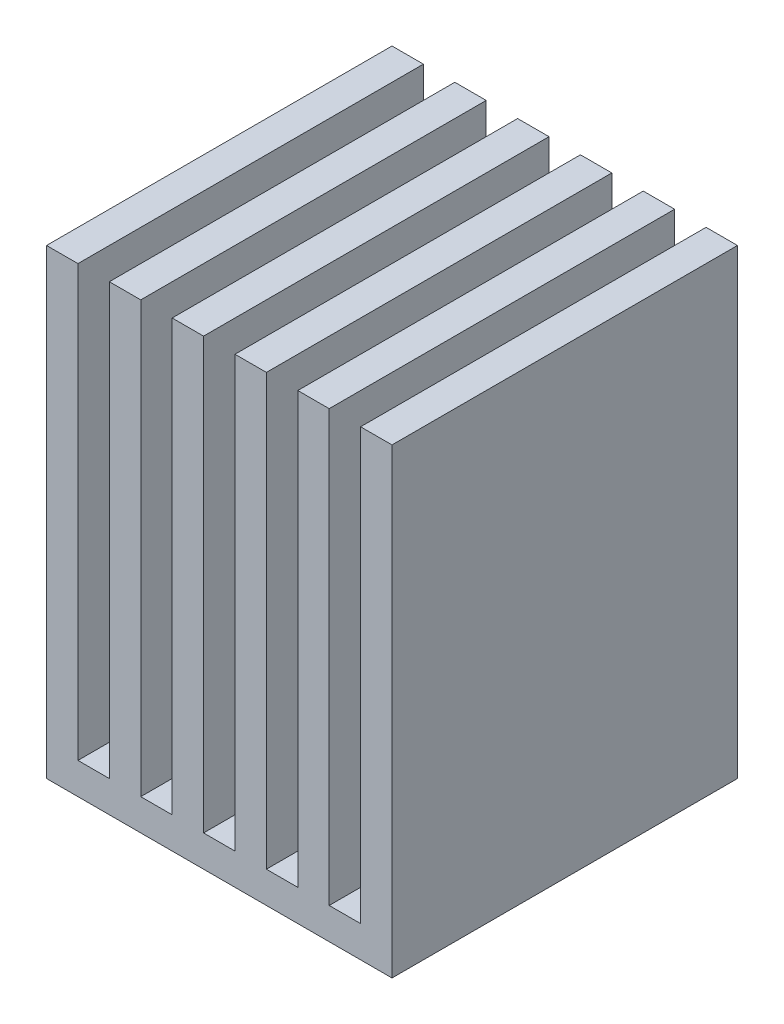
ISO-10303-21;
HEADER;
FILE_DESCRIPTION(('STEP AP214'),'2;1');
FILE_NAME('part.step','',(''),(''),'','','');
FILE_SCHEMA(('AUTOMOTIVE_DESIGN { 1 0 10303 214 1 1 1 1 }'));
ENDSEC;
DATA;
#1=APPLICATION_CONTEXT('core data for automotive mechanical design processes');
#2=APPLICATION_PROTOCOL_DEFINITION('international standard','automotive_design',2000,#1);
#3=PRODUCT_CONTEXT('',#1,'mechanical');
#4=PRODUCT('Part','Part','',(#3));
#5=PRODUCT_RELATED_PRODUCT_CATEGORY('part','',(#4));
#6=PRODUCT_DEFINITION_FORMATION('','',#4);
#7=PRODUCT_DEFINITION_CONTEXT('part definition',#1,'design');
#8=PRODUCT_DEFINITION('design','',#6,#7);
#9=PRODUCT_DEFINITION_SHAPE('','',#8);
#10=(LENGTH_UNIT() NAMED_UNIT(*) SI_UNIT(.MILLI.,.METRE.));
#11=(NAMED_UNIT(*) PLANE_ANGLE_UNIT() SI_UNIT($,.RADIAN.));
#12=(NAMED_UNIT(*) SI_UNIT($,.STERADIAN.) SOLID_ANGLE_UNIT());
#13=UNCERTAINTY_MEASURE_WITH_UNIT(LENGTH_MEASURE(1.E-05),#10,'distance_accuracy_value','');
#14=(GEOMETRIC_REPRESENTATION_CONTEXT(3) GLOBAL_UNCERTAINTY_ASSIGNED_CONTEXT((#13)) GLOBAL_UNIT_ASSIGNED_CONTEXT((#10,
#11,#12)) REPRESENTATION_CONTEXT('',''));
#15=CARTESIAN_POINT('',(0.,0.,0.));
#16=DIRECTION('',(0.,0.,1.));
#17=DIRECTION('',(1.,0.,0.));
#18=AXIS2_PLACEMENT_3D('',#15,#16,#17);
#19=CARTESIAN_POINT('',(20.,5.,20.));
#20=DIRECTION('',(-1.,0.,0.));
#21=DIRECTION('',(0.,0.,1.));
#22=AXIS2_PLACEMENT_3D('',#19,#20,#21);
#23=PLANE('',#22);
#24=DIRECTION('',(0.,0.,-1.));
#25=VECTOR('',#24,1.);
#26=CARTESIAN_POINT('',(20.,-5.,20.));
#27=LINE('',#26,#25);
#28=CARTESIAN_POINT('',(20.,-5.,20.));
#29=VERTEX_POINT('',#28);
#30=CARTESIAN_POINT('',(20.,-5.,-20.));
#31=VERTEX_POINT('',#30);
#32=EDGE_CURVE('E260',#29,#31,#27,.T.);
#33=ORIENTED_EDGE('',*,*,#32,.T.);
#34=DIRECTION('',(0.,-1.,0.));
#35=VECTOR('',#34,1.);
#36=CARTESIAN_POINT('',(20.,5.,-20.));
#37=LINE('',#36,#35);
#38=CARTESIAN_POINT('',(20.,5.,-20.));
#39=VERTEX_POINT('',#38);
#40=EDGE_CURVE('E11',#39,#31,#37,.T.);
#41=ORIENTED_EDGE('',*,*,#40,.F.);
#42=DIRECTION('',(0.,0.,-1.));
#43=VECTOR('',#42,1.);
#44=CARTESIAN_POINT('',(20.,5.,20.));
#45=LINE('',#44,#43);
#46=CARTESIAN_POINT('',(20.,5.,20.));
#47=VERTEX_POINT('',#46);
#48=EDGE_CURVE('E269',#47,#39,#45,.T.);
#49=ORIENTED_EDGE('',*,*,#48,.F.);
#50=DIRECTION('',(0.,-1.,0.));
#51=VECTOR('',#50,1.);
#52=CARTESIAN_POINT('',(20.,5.,20.));
#53=LINE('',#52,#51);
#54=EDGE_CURVE('E278',#47,#29,#53,.T.);
#55=ORIENTED_EDGE('',*,*,#54,.T.);
#56=EDGE_LOOP('',(#33,#41,#49,#55));
#57=FACE_BOUND('',#56,.T.);
#58=ADVANCED_FACE('F43',(#57),#23,.F.);
#59=CARTESIAN_POINT('',(-20.,5.,-20.));
#60=DIRECTION('',(0.,0.,1.));
#61=DIRECTION('',(1.,0.,0.));
#62=AXIS2_PLACEMENT_3D('',#59,#60,#61);
#63=PLANE('',#62);
#64=DIRECTION('',(-1.,0.,0.));
#65=VECTOR('',#64,1.);
#66=CARTESIAN_POINT('',(-20.,-5.,-20.));
#67=LINE('',#66,#65);
#68=CARTESIAN_POINT('',(-20.,-5.,-20.));
#69=VERTEX_POINT('',#68);
#70=EDGE_CURVE('E263',#31,#69,#67,.T.);
#71=ORIENTED_EDGE('',*,*,#70,.T.);
#72=DIRECTION('',(0.,-1.,0.));
#73=VECTOR('',#72,1.);
#74=CARTESIAN_POINT('',(-20.,5.,-20.));
#75=LINE('',#74,#73);
#76=CARTESIAN_POINT('',(-20.,5.,-20.));
#77=VERTEX_POINT('',#76);
#78=EDGE_CURVE('E51',#77,#69,#75,.T.);
#79=ORIENTED_EDGE('',*,*,#78,.F.);
#80=DIRECTION('',(-1.,0.,0.));
#81=VECTOR('',#80,1.);
#82=CARTESIAN_POINT('',(-20.,5.,-20.));
#83=LINE('',#82,#81);
#84=EDGE_CURVE('E85',#39,#77,#83,.T.);
#85=ORIENTED_EDGE('',*,*,#84,.F.);
#86=ORIENTED_EDGE('',*,*,#40,.T.);
#87=EDGE_LOOP('',(#71,#79,#85,#86));
#88=FACE_BOUND('',#87,.T.);
#89=ADVANCED_FACE('F304',(#88),#63,.F.);
#90=CARTESIAN_POINT('',(-20.,5.,20.));
#91=DIRECTION('',(1.,0.,0.));
#92=DIRECTION('',(0.,0.,-1.));
#93=AXIS2_PLACEMENT_3D('',#90,#91,#92);
#94=PLANE('',#93);
#95=DIRECTION('',(0.,0.,1.));
#96=VECTOR('',#95,1.);
#97=CARTESIAN_POINT('',(-20.,-5.,20.));
#98=LINE('',#97,#96);
#99=CARTESIAN_POINT('',(-20.,-5.,20.));
#100=VERTEX_POINT('',#99);
#101=EDGE_CURVE('E75',#69,#100,#98,.T.);
#102=ORIENTED_EDGE('',*,*,#101,.T.);
#103=DIRECTION('',(0.,-1.,0.));
#104=VECTOR('',#103,1.);
#105=CARTESIAN_POINT('',(-20.,5.,20.));
#106=LINE('',#105,#104);
#107=CARTESIAN_POINT('',(-20.,5.,20.));
#108=VERTEX_POINT('',#107);
#109=EDGE_CURVE('E59',#108,#100,#106,.T.);
#110=ORIENTED_EDGE('',*,*,#109,.F.);
#111=DIRECTION('',(0.,0.,1.));
#112=VECTOR('',#111,1.);
#113=CARTESIAN_POINT('',(-20.,5.,20.));
#114=LINE('',#113,#112);
#115=EDGE_CURVE('E273',#77,#108,#114,.T.);
#116=ORIENTED_EDGE('',*,*,#115,.F.);
#117=ORIENTED_EDGE('',*,*,#78,.T.);
#118=EDGE_LOOP('',(#102,#110,#116,#117));
#119=FACE_BOUND('',#118,.T.);
#120=ADVANCED_FACE('F284',(#119),#94,.F.);
#121=CARTESIAN_POINT('',(-20.,5.,20.));
#122=DIRECTION('',(0.,0.,-1.));
#123=DIRECTION('',(-1.,0.,0.));
#124=AXIS2_PLACEMENT_3D('',#121,#122,#123);
#125=PLANE('',#124);
#126=DIRECTION('',(1.,0.,0.));
#127=VECTOR('',#126,1.);
#128=CARTESIAN_POINT('',(-20.,-5.,20.));
#129=LINE('',#128,#127);
#130=EDGE_CURVE('E80',#100,#29,#129,.T.);
#131=ORIENTED_EDGE('',*,*,#130,.T.);
#132=ORIENTED_EDGE('',*,*,#54,.F.);
#133=DIRECTION('',(1.,0.,0.));
#134=VECTOR('',#133,1.);
#135=CARTESIAN_POINT('',(-20.,5.,20.));
#136=LINE('',#135,#134);
#137=EDGE_CURVE('E276',#108,#47,#136,.T.);
#138=ORIENTED_EDGE('',*,*,#137,.F.);
#139=ORIENTED_EDGE('',*,*,#109,.T.);
#140=EDGE_LOOP('',(#131,#132,#138,#139));
#141=FACE_BOUND('',#140,.T.);
#142=ADVANCED_FACE('F289',(#141),#125,.F.);
#143=CARTESIAN_POINT('',(0.,-5.,0.));
#144=DIRECTION('',(0.,-1.,0.));
#145=DIRECTION('',(0.,0.,-1.));
#146=AXIS2_PLACEMENT_3D('',#143,#144,#145);
#147=PLANE('',#146);
#148=ORIENTED_EDGE('',*,*,#32,.F.);
#149=ORIENTED_EDGE('',*,*,#130,.F.);
#150=ORIENTED_EDGE('',*,*,#101,.F.);
#151=ORIENTED_EDGE('',*,*,#70,.F.);
#152=EDGE_LOOP('',(#148,#149,#150,#151));
#153=FACE_BOUND('',#152,.T.);
#154=ADVANCED_FACE('F287',(#153),#147,.T.);
#155=CARTESIAN_POINT('',(0.,5.,55.));
#156=DIRECTION('',(0.,1.,0.));
#157=DIRECTION('',(0.,0.,1.));
#158=AXIS2_PLACEMENT_3D('',#155,#156,#157);
#159=PLANE('',#158);
#160=DIRECTION('',(1.,0.,0.));
#161=VECTOR('',#160,1.);
#162=CARTESIAN_POINT('',(0.,5.,-55.));
#163=LINE('',#162,#161);
#164=CARTESIAN_POINT('',(-54.9999999999999,5.,-55.));
#165=VERTEX_POINT('',#164);
#166=CARTESIAN_POINT('',(55.,5.,-55.));
#167=VERTEX_POINT('',#166);
#168=EDGE_CURVE('E863',#165,#167,#163,.T.);
#169=ORIENTED_EDGE('',*,*,#168,.T.);
#170=DIRECTION('',(0.,0.,-1.));
#171=VECTOR('',#170,1.);
#172=CARTESIAN_POINT('',(55.,5.,55.));
#173=LINE('',#172,#171);
#174=CARTESIAN_POINT('',(55.,5.,55.));
#175=VERTEX_POINT('',#174);
#176=EDGE_CURVE('E265',#175,#167,#173,.T.);
#177=ORIENTED_EDGE('',*,*,#176,.F.);
#178=DIRECTION('',(1.,0.,0.));
#179=VECTOR('',#178,1.);
#180=CARTESIAN_POINT('',(0.,5.,55.));
#181=LINE('',#180,#179);
#182=CARTESIAN_POINT('',(-54.9999999999999,5.,55.));
#183=VERTEX_POINT('',#182);
#184=EDGE_CURVE('E246',#183,#175,#181,.T.);
#185=ORIENTED_EDGE('',*,*,#184,.F.);
#186=DIRECTION('',(0.,0.,-1.));
#187=VECTOR('',#186,1.);
#188=CARTESIAN_POINT('',(-54.9999999999999,5.,55.));
#189=LINE('',#188,#187);
#190=EDGE_CURVE('E243',#183,#165,#189,.T.);
#191=ORIENTED_EDGE('',*,*,#190,.T.);
#192=EDGE_LOOP('',(#169,#177,#185,#191));
#193=FACE_BOUND('',#192,.T.);
#194=ORIENTED_EDGE('',*,*,#137,.T.);
#195=ORIENTED_EDGE('',*,*,#48,.T.);
#196=ORIENTED_EDGE('',*,*,#84,.T.);
#197=ORIENTED_EDGE('',*,*,#115,.T.);
#198=EDGE_LOOP('',(#194,#195,#196,#197));
#199=FACE_BOUND('',#198,.T.);
#200=ADVANCED_FACE('F291',(#193,#199),#159,.F.);
#201=CARTESIAN_POINT('',(0.,152.,55.));
#202=DIRECTION('',(0.,-1.,0.));
#203=DIRECTION('',(0.,0.,-1.));
#204=AXIS2_PLACEMENT_3D('',#201,#202,#203);
#205=PLANE('',#204);
#206=DIRECTION('',(-1.,0.,0.));
#207=VECTOR('',#206,1.);
#208=CARTESIAN_POINT('',(0.,152.,-55.));
#209=LINE('',#208,#207);
#210=CARTESIAN_POINT('',(-45.,152.,-55.));
#211=VERTEX_POINT('',#210);
#212=CARTESIAN_POINT('',(-54.9999999999999,152.,-55.));
#213=VERTEX_POINT('',#212);
#214=EDGE_CURVE('E259',#211,#213,#209,.T.);
#215=ORIENTED_EDGE('',*,*,#214,.T.);
#216=DIRECTION('',(0.,0.,-1.));
#217=VECTOR('',#216,1.);
#218=CARTESIAN_POINT('',(-54.9999999999999,152.,55.));
#219=LINE('',#218,#217);
#220=CARTESIAN_POINT('',(-54.9999999999999,152.,55.));
#221=VERTEX_POINT('',#220);
#222=EDGE_CURVE('E240',#221,#213,#219,.T.);
#223=ORIENTED_EDGE('',*,*,#222,.F.);
#224=DIRECTION('',(-1.,0.,0.));
#225=VECTOR('',#224,1.);
#226=CARTESIAN_POINT('',(0.,152.,55.));
#227=LINE('',#226,#225);
#228=CARTESIAN_POINT('',(-45.,152.,55.));
#229=VERTEX_POINT('',#228);
#230=EDGE_CURVE('E247',#229,#221,#227,.T.);
#231=ORIENTED_EDGE('',*,*,#230,.F.);
#232=DIRECTION('',(0.,0.,-1.));
#233=VECTOR('',#232,1.);
#234=CARTESIAN_POINT('',(-45.,152.,55.));
#235=LINE('',#234,#233);
#236=EDGE_CURVE('E805',#229,#211,#235,.T.);
#237=ORIENTED_EDGE('',*,*,#236,.T.);
#238=EDGE_LOOP('',(#215,#223,#231,#237));
#239=FACE_BOUND('',#238,.T.);
#240=ADVANCED_FACE('F257',(#239),#205,.F.);
#241=CARTESIAN_POINT('',(-54.9999999999999,0.,55.));
#242=DIRECTION('',(1.,0.,0.));
#243=DIRECTION('',(0.,0.,-1.));
#244=AXIS2_PLACEMENT_3D('',#241,#242,#243);
#245=PLANE('',#244);
#246=DIRECTION('',(0.,-1.,0.));
#247=VECTOR('',#246,1.);
#248=CARTESIAN_POINT('',(-54.9999999999999,0.,-55.));
#249=LINE('',#248,#247);
#250=EDGE_CURVE('E867',#213,#165,#249,.T.);
#251=ORIENTED_EDGE('',*,*,#250,.T.);
#252=ORIENTED_EDGE('',*,*,#190,.F.);
#253=DIRECTION('',(0.,-1.,0.));
#254=VECTOR('',#253,1.);
#255=CARTESIAN_POINT('',(-54.9999999999999,0.,55.));
#256=LINE('',#255,#254);
#257=EDGE_CURVE('E236',#221,#183,#256,.T.);
#258=ORIENTED_EDGE('',*,*,#257,.F.);
#259=ORIENTED_EDGE('',*,*,#222,.T.);
#260=EDGE_LOOP('',(#251,#252,#258,#259));
#261=FACE_BOUND('',#260,.T.);
#262=ADVANCED_FACE('F238',(#261),#245,.F.);
#263=CARTESIAN_POINT('',(55.,0.,55.));
#264=DIRECTION('',(-1.,0.,0.));
#265=DIRECTION('',(0.,0.,1.));
#266=AXIS2_PLACEMENT_3D('',#263,#264,#265);
#267=PLANE('',#266);
#268=DIRECTION('',(0.,1.,0.));
#269=VECTOR('',#268,1.);
#270=CARTESIAN_POINT('',(55.,0.,-55.));
#271=LINE('',#270,#269);
#272=CARTESIAN_POINT('',(55.,152.,-55.));
#273=VERTEX_POINT('',#272);
#274=EDGE_CURVE('E859',#167,#273,#271,.T.);
#275=ORIENTED_EDGE('',*,*,#274,.T.);
#276=DIRECTION('',(0.,0.,-1.));
#277=VECTOR('',#276,1.);
#278=CARTESIAN_POINT('',(55.,152.,55.));
#279=LINE('',#278,#277);
#280=CARTESIAN_POINT('',(55.,152.,55.));
#281=VERTEX_POINT('',#280);
#282=EDGE_CURVE('E852',#281,#273,#279,.T.);
#283=ORIENTED_EDGE('',*,*,#282,.F.);
#284=DIRECTION('',(0.,1.,0.));
#285=VECTOR('',#284,1.);
#286=CARTESIAN_POINT('',(55.,0.,55.));
#287=LINE('',#286,#285);
#288=EDGE_CURVE('E860',#175,#281,#287,.T.);
#289=ORIENTED_EDGE('',*,*,#288,.F.);
#290=ORIENTED_EDGE('',*,*,#176,.T.);
#291=EDGE_LOOP('',(#275,#283,#289,#290));
#292=FACE_BOUND('',#291,.T.);
#293=ADVANCED_FACE('F315',(#292),#267,.F.);
#294=CARTESIAN_POINT('',(0.,152.,55.));
#295=DIRECTION('',(0.,-1.,0.));
#296=DIRECTION('',(0.,0.,-1.));
#297=AXIS2_PLACEMENT_3D('',#294,#295,#296);
#298=PLANE('',#297);
#299=DIRECTION('',(-1.,0.,0.));
#300=VECTOR('',#299,1.);
#301=CARTESIAN_POINT('',(0.,152.,-55.));
#302=LINE('',#301,#300);
#303=CARTESIAN_POINT('',(45.,152.,-55.));
#304=VERTEX_POINT('',#303);
#305=EDGE_CURVE('E864',#273,#304,#302,.T.);
#306=ORIENTED_EDGE('',*,*,#305,.T.);
#307=DIRECTION('',(0.,0.,-1.));
#308=VECTOR('',#307,1.);
#309=CARTESIAN_POINT('',(45.,152.,55.));
#310=LINE('',#309,#308);
#311=CARTESIAN_POINT('',(45.,152.,55.));
#312=VERTEX_POINT('',#311);
#313=EDGE_CURVE('E849',#312,#304,#310,.T.);
#314=ORIENTED_EDGE('',*,*,#313,.F.);
#315=DIRECTION('',(-1.,0.,0.));
#316=VECTOR('',#315,1.);
#317=CARTESIAN_POINT('',(0.,152.,55.));
#318=LINE('',#317,#316);
#319=EDGE_CURVE('E874',#281,#312,#318,.T.);
#320=ORIENTED_EDGE('',*,*,#319,.F.);
#321=ORIENTED_EDGE('',*,*,#282,.T.);
#322=EDGE_LOOP('',(#306,#314,#320,#321));
#323=FACE_BOUND('',#322,.T.);
#324=ADVANCED_FACE('F319',(#323),#298,.F.);
#325=CARTESIAN_POINT('',(45.,0.,55.));
#326=DIRECTION('',(1.,0.,0.));
#327=DIRECTION('',(0.,0.,-1.));
#328=AXIS2_PLACEMENT_3D('',#325,#326,#327);
#329=PLANE('',#328);
#330=DIRECTION('',(0.,-1.,0.));
#331=VECTOR('',#330,1.);
#332=CARTESIAN_POINT('',(45.,0.,-55.));
#333=LINE('',#332,#331);
#334=CARTESIAN_POINT('',(45.,15.,-55.));
#335=VERTEX_POINT('',#334);
#336=EDGE_CURVE('E766',#304,#335,#333,.T.);
#337=ORIENTED_EDGE('',*,*,#336,.T.);
#338=DIRECTION('',(0.,0.,-1.));
#339=VECTOR('',#338,1.);
#340=CARTESIAN_POINT('',(45.,15.,55.));
#341=LINE('',#340,#339);
#342=CARTESIAN_POINT('',(45.,15.,55.));
#343=VERTEX_POINT('',#342);
#344=EDGE_CURVE('E763',#343,#335,#341,.T.);
#345=ORIENTED_EDGE('',*,*,#344,.F.);
#346=DIRECTION('',(0.,-1.,0.));
#347=VECTOR('',#346,1.);
#348=CARTESIAN_POINT('',(45.,0.,55.));
#349=LINE('',#348,#347);
#350=EDGE_CURVE('E872',#312,#343,#349,.T.);
#351=ORIENTED_EDGE('',*,*,#350,.F.);
#352=ORIENTED_EDGE('',*,*,#313,.T.);
#353=EDGE_LOOP('',(#337,#345,#351,#352));
#354=FACE_BOUND('',#353,.T.);
#355=ADVANCED_FACE('F324',(#354),#329,.F.);
#356=CARTESIAN_POINT('',(0.,15.,55.));
#357=DIRECTION('',(0.,-1.,0.));
#358=DIRECTION('',(1.,0.,0.));
#359=AXIS2_PLACEMENT_3D('',#356,#357,#358);
#360=PLANE('',#359);
#361=DIRECTION('',(-1.,0.,0.));
#362=VECTOR('',#361,1.);
#363=CARTESIAN_POINT('',(0.,15.,-55.));
#364=LINE('',#363,#362);
#365=CARTESIAN_POINT('',(35.,15.,-55.));
#366=VERTEX_POINT('',#365);
#367=EDGE_CURVE('E757',#335,#366,#364,.T.);
#368=ORIENTED_EDGE('',*,*,#367,.T.);
#369=DIRECTION('',(0.,0.,-1.));
#370=VECTOR('',#369,1.);
#371=CARTESIAN_POINT('',(35.,15.,55.));
#372=LINE('',#371,#370);
#373=CARTESIAN_POINT('',(35.,15.,55.));
#374=VERTEX_POINT('',#373);
#375=EDGE_CURVE('E760',#374,#366,#372,.T.);
#376=ORIENTED_EDGE('',*,*,#375,.F.);
#377=DIRECTION('',(-1.,0.,0.));
#378=VECTOR('',#377,1.);
#379=CARTESIAN_POINT('',(0.,15.,55.));
#380=LINE('',#379,#378);
#381=EDGE_CURVE('E876',#343,#374,#380,.T.);
#382=ORIENTED_EDGE('',*,*,#381,.F.);
#383=ORIENTED_EDGE('',*,*,#344,.T.);
#384=EDGE_LOOP('',(#368,#376,#382,#383));
#385=FACE_BOUND('',#384,.T.);
#386=ADVANCED_FACE('F330',(#385),#360,.F.);
#387=CARTESIAN_POINT('',(35.,0.,55.));
#388=DIRECTION('',(1.,0.,0.));
#389=DIRECTION('',(0.,0.,-1.));
#390=AXIS2_PLACEMENT_3D('',#387,#388,#389);
#391=PLANE('',#390);
#392=DIRECTION('',(0.,-1.,0.));
#393=VECTOR('',#392,1.);
#394=CARTESIAN_POINT('',(35.,0.,-55.));
#395=LINE('',#394,#393);
#396=CARTESIAN_POINT('',(35.,152.,-55.));
#397=VERTEX_POINT('',#396);
#398=EDGE_CURVE('E765',#397,#366,#395,.T.);
#399=ORIENTED_EDGE('',*,*,#398,.F.);
#400=DIRECTION('',(0.,0.,-1.));
#401=VECTOR('',#400,1.);
#402=CARTESIAN_POINT('',(35.,152.,55.));
#403=LINE('',#402,#401);
#404=CARTESIAN_POINT('',(35.,152.,55.));
#405=VERTEX_POINT('',#404);
#406=EDGE_CURVE('E845',#405,#397,#403,.T.);
#407=ORIENTED_EDGE('',*,*,#406,.F.);
#408=DIRECTION('',(0.,-1.,0.));
#409=VECTOR('',#408,1.);
#410=CARTESIAN_POINT('',(35.,0.,55.));
#411=LINE('',#410,#409);
#412=EDGE_CURVE('E882',#405,#374,#411,.T.);
#413=ORIENTED_EDGE('',*,*,#412,.T.);
#414=ORIENTED_EDGE('',*,*,#375,.T.);
#415=EDGE_LOOP('',(#399,#407,#413,#414));
#416=FACE_BOUND('',#415,.T.);
#417=ADVANCED_FACE('F332',(#416),#391,.T.);
#418=CARTESIAN_POINT('',(0.,152.,55.));
#419=DIRECTION('',(0.,-1.,0.));
#420=DIRECTION('',(0.,0.,-1.));
#421=AXIS2_PLACEMENT_3D('',#418,#419,#420);
#422=PLANE('',#421);
#423=DIRECTION('',(-1.,0.,0.));
#424=VECTOR('',#423,1.);
#425=CARTESIAN_POINT('',(0.,152.,-55.));
#426=LINE('',#425,#424);
#427=CARTESIAN_POINT('',(25.,152.,-55.));
#428=VERTEX_POINT('',#427);
#429=EDGE_CURVE('E773',#397,#428,#426,.T.);
#430=ORIENTED_EDGE('',*,*,#429,.T.);
#431=DIRECTION('',(0.,0.,-1.));
#432=VECTOR('',#431,1.);
#433=CARTESIAN_POINT('',(25.,152.,55.));
#434=LINE('',#433,#432);
#435=CARTESIAN_POINT('',(25.,152.,55.));
#436=VERTEX_POINT('',#435);
#437=EDGE_CURVE('E842',#436,#428,#434,.T.);
#438=ORIENTED_EDGE('',*,*,#437,.F.);
#439=DIRECTION('',(-1.,0.,0.));
#440=VECTOR('',#439,1.);
#441=CARTESIAN_POINT('',(0.,152.,55.));
#442=LINE('',#441,#440);
#443=EDGE_CURVE('E886',#405,#436,#442,.T.);
#444=ORIENTED_EDGE('',*,*,#443,.F.);
#445=ORIENTED_EDGE('',*,*,#406,.T.);
#446=EDGE_LOOP('',(#430,#438,#444,#445));
#447=FACE_BOUND('',#446,.T.);
#448=ADVANCED_FACE('F335',(#447),#422,.F.);
#449=CARTESIAN_POINT('',(25.,0.,55.));
#450=DIRECTION('',(1.,0.,0.));
#451=DIRECTION('',(0.,1.,0.));
#452=AXIS2_PLACEMENT_3D('',#449,#450,#451);
#453=PLANE('',#452);
#454=DIRECTION('',(0.,-1.,0.));
#455=VECTOR('',#454,1.);
#456=CARTESIAN_POINT('',(25.,0.,-55.));
#457=LINE('',#456,#455);
#458=CARTESIAN_POINT('',(25.,15.,-55.));
#459=VERTEX_POINT('',#458);
#460=EDGE_CURVE('E775',#428,#459,#457,.T.);
#461=ORIENTED_EDGE('',*,*,#460,.T.);
#462=DIRECTION('',(0.,0.,-1.));
#463=VECTOR('',#462,1.);
#464=CARTESIAN_POINT('',(25.,15.,55.));
#465=LINE('',#464,#463);
#466=CARTESIAN_POINT('',(25.,15.,55.));
#467=VERTEX_POINT('',#466);
#468=EDGE_CURVE('E839',#467,#459,#465,.T.);
#469=ORIENTED_EDGE('',*,*,#468,.F.);
#470=DIRECTION('',(0.,-1.,0.));
#471=VECTOR('',#470,1.);
#472=CARTESIAN_POINT('',(25.,0.,55.));
#473=LINE('',#472,#471);
#474=EDGE_CURVE('E888',#436,#467,#473,.T.);
#475=ORIENTED_EDGE('',*,*,#474,.F.);
#476=ORIENTED_EDGE('',*,*,#437,.T.);
#477=EDGE_LOOP('',(#461,#469,#475,#476));
#478=FACE_BOUND('',#477,.T.);
#479=ADVANCED_FACE('F339',(#478),#453,.F.);
#480=CARTESIAN_POINT('',(15.,15.,-55.));
#481=VERTEX_POINT('',#480);
#482=EDGE_CURVE('E769',#459,#481,#364,.T.);
#483=ORIENTED_EDGE('',*,*,#482,.T.);
#484=DIRECTION('',(0.,0.,-1.));
#485=VECTOR('',#484,1.);
#486=CARTESIAN_POINT('',(15.,15.,55.));
#487=LINE('',#486,#485);
#488=CARTESIAN_POINT('',(15.,15.,55.));
#489=VERTEX_POINT('',#488);
#490=EDGE_CURVE('E837',#489,#481,#487,.T.);
#491=ORIENTED_EDGE('',*,*,#490,.F.);
#492=EDGE_CURVE('E884',#467,#489,#380,.T.);
#493=ORIENTED_EDGE('',*,*,#492,.F.);
#494=ORIENTED_EDGE('',*,*,#468,.T.);
#495=EDGE_LOOP('',(#483,#491,#493,#494));
#496=FACE_BOUND('',#495,.T.);
#497=ADVANCED_FACE('F343',(#496),#360,.F.);
#498=CARTESIAN_POINT('',(15.,0.,55.));
#499=DIRECTION('',(1.,0.,0.));
#500=DIRECTION('',(0.,1.,0.));
#501=AXIS2_PLACEMENT_3D('',#498,#499,#500);
#502=PLANE('',#501);
#503=DIRECTION('',(0.,-1.,0.));
#504=VECTOR('',#503,1.);
#505=CARTESIAN_POINT('',(15.,0.,-55.));
#506=LINE('',#505,#504);
#507=CARTESIAN_POINT('',(15.,152.,-55.));
#508=VERTEX_POINT('',#507);
#509=EDGE_CURVE('E780',#508,#481,#506,.T.);
#510=ORIENTED_EDGE('',*,*,#509,.F.);
#511=DIRECTION('',(0.,0.,-1.));
#512=VECTOR('',#511,1.);
#513=CARTESIAN_POINT('',(15.,152.,55.));
#514=LINE('',#513,#512);
#515=CARTESIAN_POINT('',(15.,152.,55.));
#516=VERTEX_POINT('',#515);
#517=EDGE_CURVE('E835',#516,#508,#514,.T.);
#518=ORIENTED_EDGE('',*,*,#517,.F.);
#519=DIRECTION('',(0.,-1.,0.));
#520=VECTOR('',#519,1.);
#521=CARTESIAN_POINT('',(15.,0.,55.));
#522=LINE('',#521,#520);
#523=EDGE_CURVE('E890',#516,#489,#522,.T.);
#524=ORIENTED_EDGE('',*,*,#523,.T.);
#525=ORIENTED_EDGE('',*,*,#490,.T.);
#526=EDGE_LOOP('',(#510,#518,#524,#525));
#527=FACE_BOUND('',#526,.T.);
#528=ADVANCED_FACE('F345',(#527),#502,.T.);
#529=CARTESIAN_POINT('',(0.,152.,55.));
#530=DIRECTION('',(0.,-1.,0.));
#531=DIRECTION('',(0.,0.,-1.));
#532=AXIS2_PLACEMENT_3D('',#529,#530,#531);
#533=PLANE('',#532);
#534=DIRECTION('',(-1.,0.,0.));
#535=VECTOR('',#534,1.);
#536=CARTESIAN_POINT('',(0.,152.,-55.));
#537=LINE('',#536,#535);
#538=CARTESIAN_POINT('',(5.00000000000002,152.,-55.));
#539=VERTEX_POINT('',#538);
#540=EDGE_CURVE('E783',#508,#539,#537,.T.);
#541=ORIENTED_EDGE('',*,*,#540,.T.);
#542=DIRECTION('',(0.,0.,-1.));
#543=VECTOR('',#542,1.);
#544=CARTESIAN_POINT('',(5.00000000000002,152.,55.));
#545=LINE('',#544,#543);
#546=CARTESIAN_POINT('',(5.00000000000002,152.,55.));
#547=VERTEX_POINT('',#546);
#548=EDGE_CURVE('E832',#547,#539,#545,.T.);
#549=ORIENTED_EDGE('',*,*,#548,.F.);
#550=DIRECTION('',(-1.,0.,0.));
#551=VECTOR('',#550,1.);
#552=CARTESIAN_POINT('',(0.,152.,55.));
#553=LINE('',#552,#551);
#554=EDGE_CURVE('E893',#516,#547,#553,.T.);
#555=ORIENTED_EDGE('',*,*,#554,.F.);
#556=ORIENTED_EDGE('',*,*,#517,.T.);
#557=EDGE_LOOP('',(#541,#549,#555,#556));
#558=FACE_BOUND('',#557,.T.);
#559=ADVANCED_FACE('F348',(#558),#533,.F.);
#560=CARTESIAN_POINT('',(5.00000000000001,0.,55.));
#561=DIRECTION('',(1.,0.,0.));
#562=DIRECTION('',(0.,1.,0.));
#563=AXIS2_PLACEMENT_3D('',#560,#561,#562);
#564=PLANE('',#563);
#565=DIRECTION('',(0.,-1.,0.));
#566=VECTOR('',#565,1.);
#567=CARTESIAN_POINT('',(5.00000000000001,0.,-55.));
#568=LINE('',#567,#566);
#569=CARTESIAN_POINT('',(5.00000000000002,15.,-55.));
#570=VERTEX_POINT('',#569);
#571=EDGE_CURVE('E785',#539,#570,#568,.T.);
#572=ORIENTED_EDGE('',*,*,#571,.T.);
#573=DIRECTION('',(0.,0.,-1.));
#574=VECTOR('',#573,1.);
#575=CARTESIAN_POINT('',(5.00000000000002,15.,55.));
#576=LINE('',#575,#574);
#577=CARTESIAN_POINT('',(5.00000000000002,15.,55.));
#578=VERTEX_POINT('',#577);
#579=EDGE_CURVE('E829',#578,#570,#576,.T.);
#580=ORIENTED_EDGE('',*,*,#579,.F.);
#581=DIRECTION('',(0.,-1.,0.));
#582=VECTOR('',#581,1.);
#583=CARTESIAN_POINT('',(5.00000000000001,0.,55.));
#584=LINE('',#583,#582);
#585=EDGE_CURVE('E895',#547,#578,#584,.T.);
#586=ORIENTED_EDGE('',*,*,#585,.F.);
#587=ORIENTED_EDGE('',*,*,#548,.T.);
#588=EDGE_LOOP('',(#572,#580,#586,#587));
#589=FACE_BOUND('',#588,.T.);
#590=ADVANCED_FACE('F352',(#589),#564,.F.);
#591=CARTESIAN_POINT('',(-4.99999999999998,15.,-55.));
#592=VERTEX_POINT('',#591);
#593=EDGE_CURVE('E787',#570,#592,#364,.T.);
#594=ORIENTED_EDGE('',*,*,#593,.T.);
#595=DIRECTION('',(0.,0.,-1.));
#596=VECTOR('',#595,1.);
#597=CARTESIAN_POINT('',(-4.99999999999998,15.,55.));
#598=LINE('',#597,#596);
#599=CARTESIAN_POINT('',(-4.99999999999998,15.,55.));
#600=VERTEX_POINT('',#599);
#601=EDGE_CURVE('E827',#600,#592,#598,.T.);
#602=ORIENTED_EDGE('',*,*,#601,.F.);
#603=EDGE_CURVE('E897',#578,#600,#380,.T.);
#604=ORIENTED_EDGE('',*,*,#603,.F.);
#605=ORIENTED_EDGE('',*,*,#579,.T.);
#606=EDGE_LOOP('',(#594,#602,#604,#605));
#607=FACE_BOUND('',#606,.T.);
#608=ADVANCED_FACE('F356',(#607),#360,.F.);
#609=CARTESIAN_POINT('',(-4.99999999999998,0.,55.));
#610=DIRECTION('',(1.,0.,0.));
#611=DIRECTION('',(0.,1.,0.));
#612=AXIS2_PLACEMENT_3D('',#609,#610,#611);
#613=PLANE('',#612);
#614=DIRECTION('',(0.,-1.,0.));
#615=VECTOR('',#614,1.);
#616=CARTESIAN_POINT('',(-4.99999999999998,0.,-55.));
#617=LINE('',#616,#615);
#618=CARTESIAN_POINT('',(-4.99999999999998,152.,-55.));
#619=VERTEX_POINT('',#618);
#620=EDGE_CURVE('E788',#619,#592,#617,.T.);
#621=ORIENTED_EDGE('',*,*,#620,.F.);
#622=DIRECTION('',(0.,0.,-1.));
#623=VECTOR('',#622,1.);
#624=CARTESIAN_POINT('',(-4.99999999999998,152.,55.));
#625=LINE('',#624,#623);
#626=CARTESIAN_POINT('',(-4.99999999999998,152.,55.));
#627=VERTEX_POINT('',#626);
#628=EDGE_CURVE('E825',#627,#619,#625,.T.);
#629=ORIENTED_EDGE('',*,*,#628,.F.);
#630=DIRECTION('',(0.,-1.,0.));
#631=VECTOR('',#630,1.);
#632=CARTESIAN_POINT('',(-4.99999999999998,0.,55.));
#633=LINE('',#632,#631);
#634=EDGE_CURVE('E898',#627,#600,#633,.T.);
#635=ORIENTED_EDGE('',*,*,#634,.T.);
#636=ORIENTED_EDGE('',*,*,#601,.T.);
#637=EDGE_LOOP('',(#621,#629,#635,#636));
#638=FACE_BOUND('',#637,.T.);
#639=ADVANCED_FACE('F358',(#638),#613,.T.);
#640=CARTESIAN_POINT('',(0.,152.,55.));
#641=DIRECTION('',(0.,-1.,0.));
#642=DIRECTION('',(0.,0.,-1.));
#643=AXIS2_PLACEMENT_3D('',#640,#641,#642);
#644=PLANE('',#643);
#645=DIRECTION('',(-1.,0.,0.));
#646=VECTOR('',#645,1.);
#647=CARTESIAN_POINT('',(0.,152.,-55.));
#648=LINE('',#647,#646);
#649=CARTESIAN_POINT('',(-15.,152.,-55.));
#650=VERTEX_POINT('',#649);
#651=EDGE_CURVE('E791',#619,#650,#648,.T.);
#652=ORIENTED_EDGE('',*,*,#651,.T.);
#653=DIRECTION('',(0.,0.,-1.));
#654=VECTOR('',#653,1.);
#655=CARTESIAN_POINT('',(-15.,152.,55.));
#656=LINE('',#655,#654);
#657=CARTESIAN_POINT('',(-15.,152.,55.));
#658=VERTEX_POINT('',#657);
#659=EDGE_CURVE('E822',#658,#650,#656,.T.);
#660=ORIENTED_EDGE('',*,*,#659,.F.);
#661=DIRECTION('',(-1.,0.,0.));
#662=VECTOR('',#661,1.);
#663=CARTESIAN_POINT('',(0.,152.,55.));
#664=LINE('',#663,#662);
#665=EDGE_CURVE('E901',#627,#658,#664,.T.);
#666=ORIENTED_EDGE('',*,*,#665,.F.);
#667=ORIENTED_EDGE('',*,*,#628,.T.);
#668=EDGE_LOOP('',(#652,#660,#666,#667));
#669=FACE_BOUND('',#668,.T.);
#670=ADVANCED_FACE('F361',(#669),#644,.F.);
#671=CARTESIAN_POINT('',(-15.,0.,55.));
#672=DIRECTION('',(1.,0.,0.));
#673=DIRECTION('',(0.,1.,0.));
#674=AXIS2_PLACEMENT_3D('',#671,#672,#673);
#675=PLANE('',#674);
#676=DIRECTION('',(0.,-1.,0.));
#677=VECTOR('',#676,1.);
#678=CARTESIAN_POINT('',(-15.,0.,-55.));
#679=LINE('',#678,#677);
#680=CARTESIAN_POINT('',(-15.,15.,-55.));
#681=VERTEX_POINT('',#680);
#682=EDGE_CURVE('E793',#650,#681,#679,.T.);
#683=ORIENTED_EDGE('',*,*,#682,.T.);
#684=DIRECTION('',(0.,0.,-1.));
#685=VECTOR('',#684,1.);
#686=CARTESIAN_POINT('',(-15.,15.,55.));
#687=LINE('',#686,#685);
#688=CARTESIAN_POINT('',(-15.,15.,55.));
#689=VERTEX_POINT('',#688);
#690=EDGE_CURVE('E819',#689,#681,#687,.T.);
#691=ORIENTED_EDGE('',*,*,#690,.F.);
#692=DIRECTION('',(0.,-1.,0.));
#693=VECTOR('',#692,1.);
#694=CARTESIAN_POINT('',(-15.,0.,55.));
#695=LINE('',#694,#693);
#696=EDGE_CURVE('E903',#658,#689,#695,.T.);
#697=ORIENTED_EDGE('',*,*,#696,.F.);
#698=ORIENTED_EDGE('',*,*,#659,.T.);
#699=EDGE_LOOP('',(#683,#691,#697,#698));
#700=FACE_BOUND('',#699,.T.);
#701=ADVANCED_FACE('F365',(#700),#675,.F.);
#702=CARTESIAN_POINT('',(-25.,15.,-55.));
#703=VERTEX_POINT('',#702);
#704=EDGE_CURVE('E795',#681,#703,#364,.T.);
#705=ORIENTED_EDGE('',*,*,#704,.T.);
#706=DIRECTION('',(0.,0.,-1.));
#707=VECTOR('',#706,1.);
#708=CARTESIAN_POINT('',(-25.,15.,55.));
#709=LINE('',#708,#707);
#710=CARTESIAN_POINT('',(-25.,15.,55.));
#711=VERTEX_POINT('',#710);
#712=EDGE_CURVE('E817',#711,#703,#709,.T.);
#713=ORIENTED_EDGE('',*,*,#712,.F.);
#714=EDGE_CURVE('E905',#689,#711,#380,.T.);
#715=ORIENTED_EDGE('',*,*,#714,.F.);
#716=ORIENTED_EDGE('',*,*,#690,.T.);
#717=EDGE_LOOP('',(#705,#713,#715,#716));
#718=FACE_BOUND('',#717,.T.);
#719=ADVANCED_FACE('F369',(#718),#360,.F.);
#720=CARTESIAN_POINT('',(-25.,0.,55.));
#721=DIRECTION('',(1.,0.,0.));
#722=DIRECTION('',(0.,1.,0.));
#723=AXIS2_PLACEMENT_3D('',#720,#721,#722);
#724=PLANE('',#723);
#725=DIRECTION('',(0.,-1.,0.));
#726=VECTOR('',#725,1.);
#727=CARTESIAN_POINT('',(-25.,0.,-55.));
#728=LINE('',#727,#726);
#729=CARTESIAN_POINT('',(-25.,152.,-55.));
#730=VERTEX_POINT('',#729);
#731=EDGE_CURVE('E796',#730,#703,#728,.T.);
#732=ORIENTED_EDGE('',*,*,#731,.F.);
#733=DIRECTION('',(0.,0.,-1.));
#734=VECTOR('',#733,1.);
#735=CARTESIAN_POINT('',(-25.,152.,55.));
#736=LINE('',#735,#734);
#737=CARTESIAN_POINT('',(-25.,152.,55.));
#738=VERTEX_POINT('',#737);
#739=EDGE_CURVE('E815',#738,#730,#736,.T.);
#740=ORIENTED_EDGE('',*,*,#739,.F.);
#741=DIRECTION('',(0.,-1.,0.));
#742=VECTOR('',#741,1.);
#743=CARTESIAN_POINT('',(-25.,0.,55.));
#744=LINE('',#743,#742);
#745=EDGE_CURVE('E906',#738,#711,#744,.T.);
#746=ORIENTED_EDGE('',*,*,#745,.T.);
#747=ORIENTED_EDGE('',*,*,#712,.T.);
#748=EDGE_LOOP('',(#732,#740,#746,#747));
#749=FACE_BOUND('',#748,.T.);
#750=ADVANCED_FACE('F371',(#749),#724,.T.);
#751=CARTESIAN_POINT('',(0.,152.,55.));
#752=DIRECTION('',(0.,-1.,0.));
#753=DIRECTION('',(0.,0.,-1.));
#754=AXIS2_PLACEMENT_3D('',#751,#752,#753);
#755=PLANE('',#754);
#756=DIRECTION('',(-1.,0.,0.));
#757=VECTOR('',#756,1.);
#758=CARTESIAN_POINT('',(0.,152.,-55.));
#759=LINE('',#758,#757);
#760=CARTESIAN_POINT('',(-35.,152.,-55.));
#761=VERTEX_POINT('',#760);
#762=EDGE_CURVE('E799',#730,#761,#759,.T.);
#763=ORIENTED_EDGE('',*,*,#762,.T.);
#764=DIRECTION('',(0.,0.,-1.));
#765=VECTOR('',#764,1.);
#766=CARTESIAN_POINT('',(-35.,152.,55.));
#767=LINE('',#766,#765);
#768=CARTESIAN_POINT('',(-35.,152.,55.));
#769=VERTEX_POINT('',#768);
#770=EDGE_CURVE('E812',#769,#761,#767,.T.);
#771=ORIENTED_EDGE('',*,*,#770,.F.);
#772=DIRECTION('',(-1.,0.,0.));
#773=VECTOR('',#772,1.);
#774=CARTESIAN_POINT('',(0.,152.,55.));
#775=LINE('',#774,#773);
#776=EDGE_CURVE('E909',#738,#769,#775,.T.);
#777=ORIENTED_EDGE('',*,*,#776,.F.);
#778=ORIENTED_EDGE('',*,*,#739,.T.);
#779=EDGE_LOOP('',(#763,#771,#777,#778));
#780=FACE_BOUND('',#779,.T.);
#781=ADVANCED_FACE('F374',(#780),#755,.F.);
#782=CARTESIAN_POINT('',(-35.,0.,55.));
#783=DIRECTION('',(1.,0.,0.));
#784=DIRECTION('',(0.,1.,0.));
#785=AXIS2_PLACEMENT_3D('',#782,#783,#784);
#786=PLANE('',#785);
#787=DIRECTION('',(0.,-1.,0.));
#788=VECTOR('',#787,1.);
#789=CARTESIAN_POINT('',(-35.,0.,-55.));
#790=LINE('',#789,#788);
#791=CARTESIAN_POINT('',(-35.,15.,-55.));
#792=VERTEX_POINT('',#791);
#793=EDGE_CURVE('E801',#761,#792,#790,.T.);
#794=ORIENTED_EDGE('',*,*,#793,.T.);
#795=DIRECTION('',(0.,0.,-1.));
#796=VECTOR('',#795,1.);
#797=CARTESIAN_POINT('',(-35.,15.,55.));
#798=LINE('',#797,#796);
#799=CARTESIAN_POINT('',(-35.,15.,55.));
#800=VERTEX_POINT('',#799);
#801=EDGE_CURVE('E809',#800,#792,#798,.T.);
#802=ORIENTED_EDGE('',*,*,#801,.F.);
#803=DIRECTION('',(0.,-1.,0.));
#804=VECTOR('',#803,1.);
#805=CARTESIAN_POINT('',(-35.,0.,55.));
#806=LINE('',#805,#804);
#807=EDGE_CURVE('E911',#769,#800,#806,.T.);
#808=ORIENTED_EDGE('',*,*,#807,.F.);
#809=ORIENTED_EDGE('',*,*,#770,.T.);
#810=EDGE_LOOP('',(#794,#802,#808,#809));
#811=FACE_BOUND('',#810,.T.);
#812=ADVANCED_FACE('F378',(#811),#786,.F.);
#813=CARTESIAN_POINT('',(-45.,15.,-55.));
#814=VERTEX_POINT('',#813);
#815=EDGE_CURVE('E768',#792,#814,#364,.T.);
#816=ORIENTED_EDGE('',*,*,#815,.T.);
#817=DIRECTION('',(0.,0.,-1.));
#818=VECTOR('',#817,1.);
#819=CARTESIAN_POINT('',(-45.,15.,55.));
#820=LINE('',#819,#818);
#821=CARTESIAN_POINT('',(-45.,15.,55.));
#822=VERTEX_POINT('',#821);
#823=EDGE_CURVE('E807',#822,#814,#820,.T.);
#824=ORIENTED_EDGE('',*,*,#823,.F.);
#825=EDGE_CURVE('E883',#800,#822,#380,.T.);
#826=ORIENTED_EDGE('',*,*,#825,.F.);
#827=ORIENTED_EDGE('',*,*,#801,.T.);
#828=EDGE_LOOP('',(#816,#824,#826,#827));
#829=FACE_BOUND('',#828,.T.);
#830=ADVANCED_FACE('F382',(#829),#360,.F.);
#831=CARTESIAN_POINT('',(-45.,0.,55.));
#832=DIRECTION('',(1.,0.,0.));
#833=DIRECTION('',(0.,1.,0.));
#834=AXIS2_PLACEMENT_3D('',#831,#832,#833);
#835=PLANE('',#834);
#836=DIRECTION('',(0.,-1.,0.));
#837=VECTOR('',#836,1.);
#838=CARTESIAN_POINT('',(-45.,0.,-55.));
#839=LINE('',#838,#837);
#840=EDGE_CURVE('E255',#211,#814,#839,.T.);
#841=ORIENTED_EDGE('',*,*,#840,.F.);
#842=ORIENTED_EDGE('',*,*,#236,.F.);
#843=DIRECTION('',(0.,-1.,0.));
#844=VECTOR('',#843,1.);
#845=CARTESIAN_POINT('',(-45.,0.,55.));
#846=LINE('',#845,#844);
#847=EDGE_CURVE('E253',#229,#822,#846,.T.);
#848=ORIENTED_EDGE('',*,*,#847,.T.);
#849=ORIENTED_EDGE('',*,*,#823,.T.);
#850=EDGE_LOOP('',(#841,#842,#848,#849));
#851=FACE_BOUND('',#850,.T.);
#852=ADVANCED_FACE('F386',(#851),#835,.T.);
#853=CARTESIAN_POINT('',(0.,0.,55.));
#854=DIRECTION('',(0.,0.,1.));
#855=DIRECTION('',(1.,0.,0.));
#856=AXIS2_PLACEMENT_3D('',#853,#854,#855);
#857=PLANE('',#856);
#858=ORIENTED_EDGE('',*,*,#230,.T.);
#859=ORIENTED_EDGE('',*,*,#257,.T.);
#860=ORIENTED_EDGE('',*,*,#184,.T.);
#861=ORIENTED_EDGE('',*,*,#288,.T.);
#862=ORIENTED_EDGE('',*,*,#319,.T.);
#863=ORIENTED_EDGE('',*,*,#350,.T.);
#864=ORIENTED_EDGE('',*,*,#381,.T.);
#865=ORIENTED_EDGE('',*,*,#412,.F.);
#866=ORIENTED_EDGE('',*,*,#443,.T.);
#867=ORIENTED_EDGE('',*,*,#474,.T.);
#868=ORIENTED_EDGE('',*,*,#492,.T.);
#869=ORIENTED_EDGE('',*,*,#523,.F.);
#870=ORIENTED_EDGE('',*,*,#554,.T.);
#871=ORIENTED_EDGE('',*,*,#585,.T.);
#872=ORIENTED_EDGE('',*,*,#603,.T.);
#873=ORIENTED_EDGE('',*,*,#634,.F.);
#874=ORIENTED_EDGE('',*,*,#665,.T.);
#875=ORIENTED_EDGE('',*,*,#696,.T.);
#876=ORIENTED_EDGE('',*,*,#714,.T.);
#877=ORIENTED_EDGE('',*,*,#745,.F.);
#878=ORIENTED_EDGE('',*,*,#776,.T.);
#879=ORIENTED_EDGE('',*,*,#807,.T.);
#880=ORIENTED_EDGE('',*,*,#825,.T.);
#881=ORIENTED_EDGE('',*,*,#847,.F.);
#882=EDGE_LOOP('',(#858,#859,#860,#861,#862,#863,#864,#865,#866,#867,#868,#869,#870,#871,#872,
#873,#874,#875,#876,#877,#878,#879,#880,#881));
#883=FACE_BOUND('',#882,.T.);
#884=ADVANCED_FACE('F251',(#883),#857,.T.);
#885=CARTESIAN_POINT('',(0.,0.,-55.));
#886=DIRECTION('',(0.,0.,1.));
#887=DIRECTION('',(1.,0.,0.));
#888=AXIS2_PLACEMENT_3D('',#885,#886,#887);
#889=PLANE('',#888);
#890=ORIENTED_EDGE('',*,*,#214,.F.);
#891=ORIENTED_EDGE('',*,*,#840,.T.);
#892=ORIENTED_EDGE('',*,*,#815,.F.);
#893=ORIENTED_EDGE('',*,*,#793,.F.);
#894=ORIENTED_EDGE('',*,*,#762,.F.);
#895=ORIENTED_EDGE('',*,*,#731,.T.);
#896=ORIENTED_EDGE('',*,*,#704,.F.);
#897=ORIENTED_EDGE('',*,*,#682,.F.);
#898=ORIENTED_EDGE('',*,*,#651,.F.);
#899=ORIENTED_EDGE('',*,*,#620,.T.);
#900=ORIENTED_EDGE('',*,*,#593,.F.);
#901=ORIENTED_EDGE('',*,*,#571,.F.);
#902=ORIENTED_EDGE('',*,*,#540,.F.);
#903=ORIENTED_EDGE('',*,*,#509,.T.);
#904=ORIENTED_EDGE('',*,*,#482,.F.);
#905=ORIENTED_EDGE('',*,*,#460,.F.);
#906=ORIENTED_EDGE('',*,*,#429,.F.);
#907=ORIENTED_EDGE('',*,*,#398,.T.);
#908=ORIENTED_EDGE('',*,*,#367,.F.);
#909=ORIENTED_EDGE('',*,*,#336,.F.);
#910=ORIENTED_EDGE('',*,*,#305,.F.);
#911=ORIENTED_EDGE('',*,*,#274,.F.);
#912=ORIENTED_EDGE('',*,*,#168,.F.);
#913=ORIENTED_EDGE('',*,*,#250,.F.);
#914=EDGE_LOOP('',(#890,#891,#892,#893,#894,#895,#896,#897,#898,#899,#900,#901,#902,#903,#904,
#905,#906,#907,#908,#909,#910,#911,#912,#913));
#915=FACE_BOUND('',#914,.T.);
#916=ADVANCED_FACE('F391',(#915),#889,.F.);
#917=CLOSED_SHELL('',(#58,#89,#120,#142,#154,#200,#240,#262,#293,#324,#355,#386,#417,#448,#479,
#497,#528,#559,#590,#608,#639,#670,#701,#719,#750,#781,#812,#830,#852,#884,#916));
#918=MANIFOLD_SOLID_BREP('B2',#917);
#919=ADVANCED_BREP_SHAPE_REPRESENTATION('',(#18,#918),#14);
#920=SHAPE_DEFINITION_REPRESENTATION(#9,#919);
ENDSEC;
END-ISO-10303-21;
